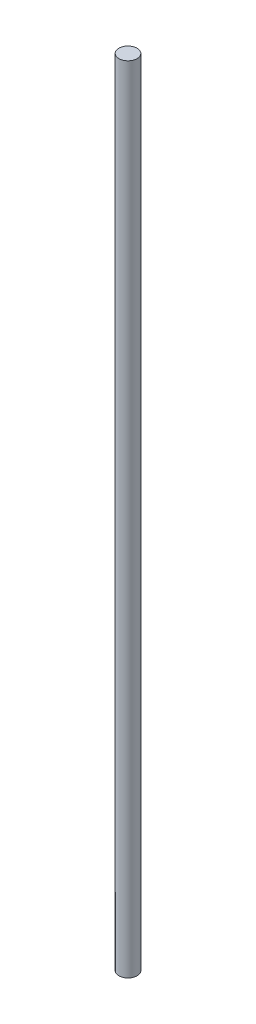
ISO-10303-21;
HEADER;
FILE_DESCRIPTION(('STEP AP214'),'2;1');
FILE_NAME('part.step','',(''),(''),'','','');
FILE_SCHEMA(('AUTOMOTIVE_DESIGN { 1 0 10303 214 1 1 1 1 }'));
ENDSEC;
DATA;
#1=APPLICATION_CONTEXT('core data for automotive mechanical design processes');
#2=APPLICATION_PROTOCOL_DEFINITION('international standard','automotive_design',2000,#1);
#3=PRODUCT_CONTEXT('',#1,'mechanical');
#4=PRODUCT('Part','Part','',(#3));
#5=PRODUCT_RELATED_PRODUCT_CATEGORY('part','',(#4));
#6=PRODUCT_DEFINITION_FORMATION('','',#4);
#7=PRODUCT_DEFINITION_CONTEXT('part definition',#1,'design');
#8=PRODUCT_DEFINITION('design','',#6,#7);
#9=PRODUCT_DEFINITION_SHAPE('','',#8);
#10=(LENGTH_UNIT() NAMED_UNIT(*) SI_UNIT(.MILLI.,.METRE.));
#11=(NAMED_UNIT(*) PLANE_ANGLE_UNIT() SI_UNIT($,.RADIAN.));
#12=(NAMED_UNIT(*) SI_UNIT($,.STERADIAN.) SOLID_ANGLE_UNIT());
#13=UNCERTAINTY_MEASURE_WITH_UNIT(LENGTH_MEASURE(1.E-05),#10,'distance_accuracy_value','');
#14=(GEOMETRIC_REPRESENTATION_CONTEXT(3) GLOBAL_UNCERTAINTY_ASSIGNED_CONTEXT((#13)) GLOBAL_UNIT_ASSIGNED_CONTEXT((#10,
#11,#12)) REPRESENTATION_CONTEXT('',''));
#15=CARTESIAN_POINT('',(0.,0.,0.));
#16=DIRECTION('',(0.,0.,1.));
#17=DIRECTION('',(1.,0.,0.));
#18=AXIS2_PLACEMENT_3D('',#15,#16,#17);
#19=CARTESIAN_POINT('',(0.,350.,0.));
#20=DIRECTION('',(0.,-1.,0.));
#21=DIRECTION('',(0.,0.,-1.));
#22=AXIS2_PLACEMENT_3D('',#19,#20,#21);
#23=CYLINDRICAL_SURFACE('',#22,4.);
#24=CARTESIAN_POINT('',(0.,350.,0.));
#25=DIRECTION('',(0.,1.,0.));
#26=DIRECTION('',(0.,0.,1.));
#27=AXIS2_PLACEMENT_3D('',#24,#25,#26);
#28=CIRCLE('',#27,4.);
#29=CARTESIAN_POINT('',(0.,350.,4.));
#30=VERTEX_POINT('',#29);
#31=EDGE_CURVE('E10',#30,#30,#28,.T.);
#32=ORIENTED_EDGE('',*,*,#31,.F.);
#33=EDGE_LOOP('',(#32));
#34=FACE_BOUND('',#33,.T.);
#35=CARTESIAN_POINT('',(0.,0.,0.));
#36=DIRECTION('',(0.,1.,0.));
#37=DIRECTION('',(0.,0.,1.));
#38=AXIS2_PLACEMENT_3D('',#35,#36,#37);
#39=CIRCLE('',#38,4.);
#40=CARTESIAN_POINT('',(0.,0.,4.));
#41=VERTEX_POINT('',#40);
#42=EDGE_CURVE('E41',#41,#41,#39,.T.);
#43=ORIENTED_EDGE('',*,*,#42,.T.);
#44=EDGE_LOOP('',(#43));
#45=FACE_BOUND('',#44,.T.);
#46=ADVANCED_FACE('F38',(#34,#45),#23,.T.);
#47=CARTESIAN_POINT('',(0.,350.,0.));
#48=DIRECTION('',(0.,1.,0.));
#49=DIRECTION('',(0.,0.,1.));
#50=AXIS2_PLACEMENT_3D('',#47,#48,#49);
#51=PLANE('',#50);
#52=ORIENTED_EDGE('',*,*,#31,.T.);
#53=EDGE_LOOP('',(#52));
#54=FACE_BOUND('',#53,.T.);
#55=ADVANCED_FACE('F53',(#54),#51,.T.);
#56=CARTESIAN_POINT('',(0.,0.,0.));
#57=DIRECTION('',(0.,1.,0.));
#58=DIRECTION('',(0.,0.,1.));
#59=AXIS2_PLACEMENT_3D('',#56,#57,#58);
#60=PLANE('',#59);
#61=ORIENTED_EDGE('',*,*,#42,.F.);
#62=EDGE_LOOP('',(#61));
#63=FACE_BOUND('',#62,.T.);
#64=ADVANCED_FACE('F51',(#63),#60,.F.);
#65=CLOSED_SHELL('',(#46,#55,#64));
#66=MANIFOLD_SOLID_BREP('B2',#65);
#67=ADVANCED_BREP_SHAPE_REPRESENTATION('',(#18,#66),#14);
#68=SHAPE_DEFINITION_REPRESENTATION(#9,#67);
ENDSEC;
END-ISO-10303-21;
